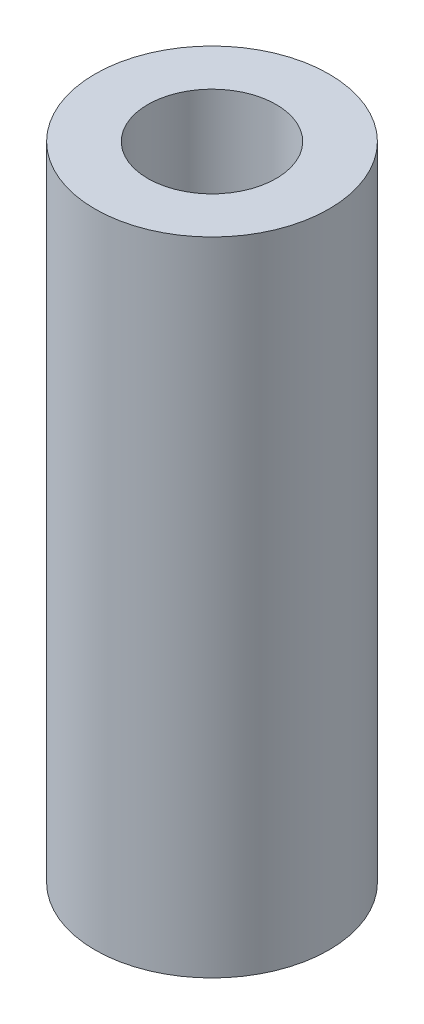
ISO-10303-21;
HEADER;
FILE_DESCRIPTION(('STEP AP214'),'2;1');
FILE_NAME('part.step','',(''),(''),'','','');
FILE_SCHEMA(('AUTOMOTIVE_DESIGN { 1 0 10303 214 1 1 1 1 }'));
ENDSEC;
DATA;
#1=APPLICATION_CONTEXT('core data for automotive mechanical design processes');
#2=APPLICATION_PROTOCOL_DEFINITION('international standard','automotive_design',2000,#1);
#3=PRODUCT_CONTEXT('',#1,'mechanical');
#4=PRODUCT('Part','Part','',(#3));
#5=PRODUCT_RELATED_PRODUCT_CATEGORY('part','',(#4));
#6=PRODUCT_DEFINITION_FORMATION('','',#4);
#7=PRODUCT_DEFINITION_CONTEXT('part definition',#1,'design');
#8=PRODUCT_DEFINITION('design','',#6,#7);
#9=PRODUCT_DEFINITION_SHAPE('','',#8);
#10=(LENGTH_UNIT() NAMED_UNIT(*) SI_UNIT(.MILLI.,.METRE.));
#11=(NAMED_UNIT(*) PLANE_ANGLE_UNIT() SI_UNIT($,.RADIAN.));
#12=(NAMED_UNIT(*) SI_UNIT($,.STERADIAN.) SOLID_ANGLE_UNIT());
#13=UNCERTAINTY_MEASURE_WITH_UNIT(LENGTH_MEASURE(1.E-05),#10,'distance_accuracy_value','');
#14=(GEOMETRIC_REPRESENTATION_CONTEXT(3) GLOBAL_UNCERTAINTY_ASSIGNED_CONTEXT((#13)) GLOBAL_UNIT_ASSIGNED_CONTEXT((#10,
#11,#12)) REPRESENTATION_CONTEXT('',''));
#15=CARTESIAN_POINT('',(0.,0.,0.));
#16=DIRECTION('',(0.,0.,1.));
#17=DIRECTION('',(1.,0.,0.));
#18=AXIS2_PLACEMENT_3D('',#15,#16,#17);
#19=CARTESIAN_POINT('',(0.,304.8,0.));
#20=DIRECTION('',(0.,1.,0.));
#21=DIRECTION('',(0.,0.,1.));
#22=AXIS2_PLACEMENT_3D('',#19,#20,#21);
#23=PLANE('',#22);
#24=CARTESIAN_POINT('',(0.,304.8,0.));
#25=DIRECTION('',(0.,1.,0.));
#26=DIRECTION('',(0.,0.,1.));
#27=AXIS2_PLACEMENT_3D('',#24,#25,#26);
#28=CIRCLE('',#27,55.5625);
#29=CARTESIAN_POINT('',(0.,304.8,55.5625));
#30=VERTEX_POINT('',#29);
#31=EDGE_CURVE('E10',#30,#30,#28,.T.);
#32=ORIENTED_EDGE('',*,*,#31,.T.);
#33=EDGE_LOOP('',(#32));
#34=FACE_BOUND('',#33,.T.);
#35=CARTESIAN_POINT('',(0.,304.8,0.));
#36=DIRECTION('',(0.,1.,0.));
#37=DIRECTION('',(0.,0.,1.));
#38=AXIS2_PLACEMENT_3D('',#35,#36,#37);
#39=CIRCLE('',#38,30.48);
#40=CARTESIAN_POINT('',(0.,304.8,30.48));
#41=VERTEX_POINT('',#40);
#42=EDGE_CURVE('E50',#41,#41,#39,.T.);
#43=ORIENTED_EDGE('',*,*,#42,.F.);
#44=EDGE_LOOP('',(#43));
#45=FACE_BOUND('',#44,.T.);
#46=ADVANCED_FACE('F37',(#34,#45),#23,.T.);
#47=CARTESIAN_POINT('',(0.,0.,0.));
#48=DIRECTION('',(0.,1.,0.));
#49=DIRECTION('',(0.,0.,1.));
#50=AXIS2_PLACEMENT_3D('',#47,#48,#49);
#51=PLANE('',#50);
#52=CARTESIAN_POINT('',(0.,0.,0.));
#53=DIRECTION('',(0.,1.,0.));
#54=DIRECTION('',(0.,0.,1.));
#55=AXIS2_PLACEMENT_3D('',#52,#53,#54);
#56=CIRCLE('',#55,55.5625);
#57=CARTESIAN_POINT('',(0.,0.,55.5625));
#58=VERTEX_POINT('',#57);
#59=EDGE_CURVE('E41',#58,#58,#56,.T.);
#60=ORIENTED_EDGE('',*,*,#59,.F.);
#61=EDGE_LOOP('',(#60));
#62=FACE_BOUND('',#61,.T.);
#63=CARTESIAN_POINT('',(0.,0.,0.));
#64=DIRECTION('',(0.,1.,0.));
#65=DIRECTION('',(0.,0.,1.));
#66=AXIS2_PLACEMENT_3D('',#63,#64,#65);
#67=CIRCLE('',#66,30.48);
#68=CARTESIAN_POINT('',(0.,0.,30.48));
#69=VERTEX_POINT('',#68);
#70=EDGE_CURVE('E52',#69,#69,#67,.T.);
#71=ORIENTED_EDGE('',*,*,#70,.T.);
#72=EDGE_LOOP('',(#71));
#73=FACE_BOUND('',#72,.T.);
#74=ADVANCED_FACE('F64',(#62,#73),#51,.F.);
#75=CARTESIAN_POINT('',(0.,304.8,0.));
#76=DIRECTION('',(0.,-1.,0.));
#77=DIRECTION('',(0.,0.,-1.));
#78=AXIS2_PLACEMENT_3D('',#75,#76,#77);
#79=CYLINDRICAL_SURFACE('',#78,55.5625);
#80=ORIENTED_EDGE('',*,*,#31,.F.);
#81=EDGE_LOOP('',(#80));
#82=FACE_BOUND('',#81,.T.);
#83=ORIENTED_EDGE('',*,*,#59,.T.);
#84=EDGE_LOOP('',(#83));
#85=FACE_BOUND('',#84,.T.);
#86=ADVANCED_FACE('F39',(#82,#85),#79,.T.);
#87=CARTESIAN_POINT('',(0.,304.8,0.));
#88=DIRECTION('',(0.,-1.,0.));
#89=DIRECTION('',(0.,0.,-1.));
#90=AXIS2_PLACEMENT_3D('',#87,#88,#89);
#91=CYLINDRICAL_SURFACE('',#90,30.48);
#92=ORIENTED_EDGE('',*,*,#42,.T.);
#93=EDGE_LOOP('',(#92));
#94=FACE_BOUND('',#93,.T.);
#95=ORIENTED_EDGE('',*,*,#70,.F.);
#96=EDGE_LOOP('',(#95));
#97=FACE_BOUND('',#96,.T.);
#98=ADVANCED_FACE('F60',(#94,#97),#91,.F.);
#99=CLOSED_SHELL('',(#46,#74,#86,#98));
#100=MANIFOLD_SOLID_BREP('B2',#99);
#101=ADVANCED_BREP_SHAPE_REPRESENTATION('',(#18,#100),#14);
#102=SHAPE_DEFINITION_REPRESENTATION(#9,#101);
ENDSEC;
END-ISO-10303-21;
